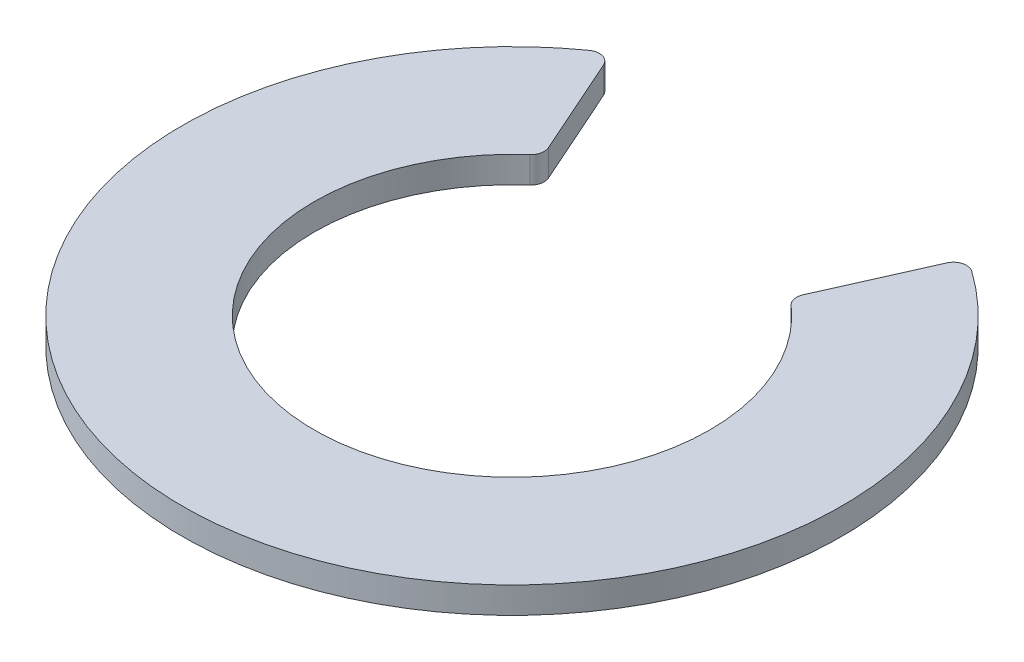
ISO-10303-21;
HEADER;
FILE_DESCRIPTION(('STEP AP214'),'2;1');
FILE_NAME('part.step','',(''),(''),'','','');
FILE_SCHEMA(('AUTOMOTIVE_DESIGN { 1 0 10303 214 1 1 1 1 }'));
ENDSEC;
DATA;
#1=APPLICATION_CONTEXT('core data for automotive mechanical design processes');
#2=APPLICATION_PROTOCOL_DEFINITION('international standard','automotive_design',2000,#1);
#3=PRODUCT_CONTEXT('',#1,'mechanical');
#4=PRODUCT('Part','Part','',(#3));
#5=PRODUCT_RELATED_PRODUCT_CATEGORY('part','',(#4));
#6=PRODUCT_DEFINITION_FORMATION('','',#4);
#7=PRODUCT_DEFINITION_CONTEXT('part definition',#1,'design');
#8=PRODUCT_DEFINITION('design','',#6,#7);
#9=PRODUCT_DEFINITION_SHAPE('','',#8);
#10=(LENGTH_UNIT() NAMED_UNIT(*) SI_UNIT(.MILLI.,.METRE.));
#11=(NAMED_UNIT(*) PLANE_ANGLE_UNIT() SI_UNIT($,.RADIAN.));
#12=(NAMED_UNIT(*) SI_UNIT($,.STERADIAN.) SOLID_ANGLE_UNIT());
#13=UNCERTAINTY_MEASURE_WITH_UNIT(LENGTH_MEASURE(1.E-05),#10,'distance_accuracy_value','');
#14=(GEOMETRIC_REPRESENTATION_CONTEXT(3) GLOBAL_UNCERTAINTY_ASSIGNED_CONTEXT((#13)) GLOBAL_UNIT_ASSIGNED_CONTEXT((#10,
#11,#12)) REPRESENTATION_CONTEXT('',''));
#15=CARTESIAN_POINT('',(0.,0.,0.));
#16=DIRECTION('',(0.,0.,1.));
#17=DIRECTION('',(1.,0.,0.));
#18=AXIS2_PLACEMENT_3D('',#15,#16,#17);
#19=CARTESIAN_POINT('',(13.9235110383462,2.,-19.5482950756595));
#20=DIRECTION('',(0.,-1.,0.));
#21=DIRECTION('',(0.,0.,-1.));
#22=AXIS2_PLACEMENT_3D('',#19,#20,#21);
#23=CYLINDRICAL_SURFACE('',#22,0.999999999999997);
#24=CARTESIAN_POINT('',(13.9235110383462,0.,-19.5482950756595));
#25=DIRECTION('',(0.,1.,0.));
#26=DIRECTION('',(0.,0.,1.));
#27=AXIS2_PLACEMENT_3D('',#24,#25,#26);
#28=CIRCLE('',#27,0.999999999999997);
#29=CARTESIAN_POINT('',(14.5036573316106,0.,-20.3628073704786));
#30=VERTEX_POINT('',#29);
#31=CARTESIAN_POINT('',(13.0097396482997,0.,-19.9545238864699));
#32=VERTEX_POINT('',#31);
#33=EDGE_CURVE('E140',#30,#32,#28,.T.);
#34=ORIENTED_EDGE('',*,*,#33,.T.);
#35=DIRECTION('',(0.,-1.,0.));
#36=VECTOR('',#35,1.);
#37=CARTESIAN_POINT('',(13.0097396482997,2.,-19.9545238864699));
#38=LINE('',#37,#36);
#39=CARTESIAN_POINT('',(13.0097396482997,2.,-19.9545238864699));
#40=VERTEX_POINT('',#39);
#41=EDGE_CURVE('E11',#40,#32,#38,.T.);
#42=ORIENTED_EDGE('',*,*,#41,.F.);
#43=CARTESIAN_POINT('',(13.9235110383462,2.,-19.5482950756595));
#44=DIRECTION('',(0.,1.,0.));
#45=DIRECTION('',(0.,0.,1.));
#46=AXIS2_PLACEMENT_3D('',#43,#44,#45);
#47=CIRCLE('',#46,0.999999999999997);
#48=CARTESIAN_POINT('',(14.5036573316106,2.,-20.3628073704786));
#49=VERTEX_POINT('',#48);
#50=EDGE_CURVE('E162',#49,#40,#47,.T.);
#51=ORIENTED_EDGE('',*,*,#50,.F.);
#52=DIRECTION('',(0.,-1.,0.));
#53=VECTOR('',#52,1.);
#54=CARTESIAN_POINT('',(14.5036573316106,2.,-20.3628073704786));
#55=LINE('',#54,#53);
#56=EDGE_CURVE('E136',#49,#30,#55,.T.);
#57=ORIENTED_EDGE('',*,*,#56,.T.);
#58=EDGE_LOOP('',(#34,#42,#51,#57));
#59=FACE_BOUND('',#58,.T.);
#60=ADVANCED_FACE('F39',(#59),#23,.T.);
#61=CARTESIAN_POINT('',(9.65832226210436,2.,-12.4158431181124));
#62=DIRECTION('',(0.913771390046496,0.,0.406228810810477));
#63=DIRECTION('',(0.406228810810477,0.,-0.913771390046496));
#64=AXIS2_PLACEMENT_3D('',#61,#62,#63);
#65=PLANE('',#64);
#66=DIRECTION('',(-0.406228810810477,0.,0.913771390046496));
#67=VECTOR('',#66,1.);
#68=CARTESIAN_POINT('',(9.65832226210436,0.,-12.4158431181124));
#69=LINE('',#68,#67);
#70=CARTESIAN_POINT('',(9.65832226210436,0.,-12.4158431181124));
#71=VERTEX_POINT('',#70);
#72=EDGE_CURVE('E144',#32,#71,#69,.T.);
#73=ORIENTED_EDGE('',*,*,#72,.T.);
#74=DIRECTION('',(0.,-1.,0.));
#75=VECTOR('',#74,1.);
#76=CARTESIAN_POINT('',(9.65832226210436,2.,-12.4158431181124));
#77=LINE('',#76,#75);
#78=CARTESIAN_POINT('',(9.65832226210436,2.,-12.4158431181124));
#79=VERTEX_POINT('',#78);
#80=EDGE_CURVE('E48',#79,#71,#77,.T.);
#81=ORIENTED_EDGE('',*,*,#80,.F.);
#82=DIRECTION('',(-0.406228810810477,0.,0.913771390046496));
#83=VECTOR('',#82,1.);
#84=CARTESIAN_POINT('',(9.65832226210436,2.,-12.4158431181124));
#85=LINE('',#84,#83);
#86=EDGE_CURVE('E99',#40,#79,#85,.T.);
#87=ORIENTED_EDGE('',*,*,#86,.F.);
#88=ORIENTED_EDGE('',*,*,#41,.T.);
#89=EDGE_LOOP('',(#73,#81,#87,#88));
#90=FACE_BOUND('',#89,.T.);
#91=ADVANCED_FACE('F208',(#90),#65,.F.);
#92=CARTESIAN_POINT('',(10.5720936521509,2.,-12.0096143073019));
#93=DIRECTION('',(0.,-1.,0.));
#94=DIRECTION('',(0.,0.,-1.));
#95=AXIS2_PLACEMENT_3D('',#92,#93,#94);
#96=CYLINDRICAL_SURFACE('',#95,1.);
#97=CARTESIAN_POINT('',(10.5720936521509,0.,-12.0096143073019));
#98=DIRECTION('',(0.,1.,0.));
#99=DIRECTION('',(0.,0.,-1.));
#100=AXIS2_PLACEMENT_3D('',#97,#98,#99);
#101=CIRCLE('',#100,1.);
#102=CARTESIAN_POINT('',(9.91133779889143,0.,-11.2590134130956));
#103=VERTEX_POINT('',#102);
#104=EDGE_CURVE('E147',#71,#103,#101,.T.);
#105=ORIENTED_EDGE('',*,*,#104,.T.);
#106=DIRECTION('',(0.,-1.,0.));
#107=VECTOR('',#106,1.);
#108=CARTESIAN_POINT('',(9.91133779889143,2.,-11.2590134130956));
#109=LINE('',#108,#107);
#110=CARTESIAN_POINT('',(9.91133779889143,2.,-11.2590134130956));
#111=VERTEX_POINT('',#110);
#112=EDGE_CURVE('E173',#111,#103,#109,.T.);
#113=ORIENTED_EDGE('',*,*,#112,.F.);
#114=CARTESIAN_POINT('',(10.5720936521509,2.,-12.0096143073019));
#115=DIRECTION('',(0.,1.,0.));
#116=DIRECTION('',(0.,0.,-1.));
#117=AXIS2_PLACEMENT_3D('',#114,#115,#116);
#118=CIRCLE('',#117,1.);
#119=EDGE_CURVE('E183',#79,#111,#118,.T.);
#120=ORIENTED_EDGE('',*,*,#119,.F.);
#121=ORIENTED_EDGE('',*,*,#80,.T.);
#122=EDGE_LOOP('',(#105,#113,#120,#121));
#123=FACE_BOUND('',#122,.T.);
#124=ADVANCED_FACE('F181',(#123),#96,.T.);
#125=CARTESIAN_POINT('',(0.,2.,0.));
#126=DIRECTION('',(0.,-1.,0.));
#127=DIRECTION('',(0.,0.,-1.));
#128=AXIS2_PLACEMENT_3D('',#125,#126,#127);
#129=CYLINDRICAL_SURFACE('',#128,15.);
#130=CARTESIAN_POINT('',(0.,0.,0.));
#131=DIRECTION('',(0.,-1.,0.));
#132=DIRECTION('',(0.,0.,1.));
#133=AXIS2_PLACEMENT_3D('',#130,#131,#132);
#134=CIRCLE('',#133,15.);
#135=CARTESIAN_POINT('',(-9.91133779889142,0.,-11.2590134130956));
#136=VERTEX_POINT('',#135);
#137=EDGE_CURVE('E150',#103,#136,#134,.T.);
#138=ORIENTED_EDGE('',*,*,#137,.T.);
#139=DIRECTION('',(0.,-1.,0.));
#140=VECTOR('',#139,1.);
#141=CARTESIAN_POINT('',(-9.91133779889142,2.,-11.2590134130956));
#142=LINE('',#141,#140);
#143=CARTESIAN_POINT('',(-9.91133779889142,2.,-11.2590134130956));
#144=VERTEX_POINT('',#143);
#145=EDGE_CURVE('E169',#144,#136,#142,.T.);
#146=ORIENTED_EDGE('',*,*,#145,.F.);
#147=CARTESIAN_POINT('',(0.,2.,0.));
#148=DIRECTION('',(0.,-1.,0.));
#149=DIRECTION('',(0.,0.,1.));
#150=AXIS2_PLACEMENT_3D('',#147,#148,#149);
#151=CIRCLE('',#150,15.);
#152=EDGE_CURVE('E196',#111,#144,#151,.T.);
#153=ORIENTED_EDGE('',*,*,#152,.F.);
#154=ORIENTED_EDGE('',*,*,#112,.T.);
#155=EDGE_LOOP('',(#138,#146,#153,#154));
#156=FACE_BOUND('',#155,.T.);
#157=ADVANCED_FACE('F191',(#156),#129,.F.);
#158=CARTESIAN_POINT('',(-10.5720936521508,2.,-12.0096143073019));
#159=DIRECTION('',(0.,-1.,0.));
#160=DIRECTION('',(0.,0.,-1.));
#161=AXIS2_PLACEMENT_3D('',#158,#159,#160);
#162=CYLINDRICAL_SURFACE('',#161,0.999999999999996);
#163=CARTESIAN_POINT('',(-10.5720936521508,0.,-12.0096143073019));
#164=DIRECTION('',(0.,1.,0.));
#165=DIRECTION('',(0.,0.,1.));
#166=AXIS2_PLACEMENT_3D('',#163,#164,#165);
#167=CIRCLE('',#166,0.999999999999996);
#168=CARTESIAN_POINT('',(-9.65832226210435,0.,-12.4158431181124));
#169=VERTEX_POINT('',#168);
#170=EDGE_CURVE('E153',#136,#169,#167,.T.);
#171=ORIENTED_EDGE('',*,*,#170,.T.);
#172=DIRECTION('',(0.,-1.,0.));
#173=VECTOR('',#172,1.);
#174=CARTESIAN_POINT('',(-9.65832226210435,2.,-12.4158431181124));
#175=LINE('',#174,#173);
#176=CARTESIAN_POINT('',(-9.65832226210435,2.,-12.4158431181124));
#177=VERTEX_POINT('',#176);
#178=EDGE_CURVE('E129',#177,#169,#175,.T.);
#179=ORIENTED_EDGE('',*,*,#178,.F.);
#180=CARTESIAN_POINT('',(-10.5720936521508,2.,-12.0096143073019));
#181=DIRECTION('',(0.,1.,0.));
#182=DIRECTION('',(0.,0.,1.));
#183=AXIS2_PLACEMENT_3D('',#180,#181,#182);
#184=CIRCLE('',#183,0.999999999999996);
#185=EDGE_CURVE('E118',#144,#177,#184,.T.);
#186=ORIENTED_EDGE('',*,*,#185,.F.);
#187=ORIENTED_EDGE('',*,*,#145,.T.);
#188=EDGE_LOOP('',(#171,#179,#186,#187));
#189=FACE_BOUND('',#188,.T.);
#190=ADVANCED_FACE('F194',(#189),#162,.T.);
#191=CARTESIAN_POINT('',(-13.0097396482997,2.,-19.95452388647));
#192=DIRECTION('',(-0.913771390046496,0.,0.406228810810477));
#193=DIRECTION('',(0.406228810810477,0.,0.913771390046496));
#194=AXIS2_PLACEMENT_3D('',#191,#192,#193);
#195=PLANE('',#194);
#196=DIRECTION('',(-0.406228810810477,0.,-0.913771390046496));
#197=VECTOR('',#196,1.);
#198=CARTESIAN_POINT('',(-13.0097396482997,0.,-19.95452388647));
#199=LINE('',#198,#197);
#200=CARTESIAN_POINT('',(-13.0097396482997,0.,-19.95452388647));
#201=VERTEX_POINT('',#200);
#202=EDGE_CURVE('E127',#169,#201,#199,.T.);
#203=ORIENTED_EDGE('',*,*,#202,.T.);
#204=DIRECTION('',(0.,-1.,0.));
#205=VECTOR('',#204,1.);
#206=CARTESIAN_POINT('',(-13.0097396482997,2.,-19.95452388647));
#207=LINE('',#206,#205);
#208=CARTESIAN_POINT('',(-13.0097396482997,2.,-19.95452388647));
#209=VERTEX_POINT('',#208);
#210=EDGE_CURVE('E124',#209,#201,#207,.T.);
#211=ORIENTED_EDGE('',*,*,#210,.F.);
#212=DIRECTION('',(-0.406228810810477,0.,-0.913771390046496));
#213=VECTOR('',#212,1.);
#214=CARTESIAN_POINT('',(-13.0097396482997,2.,-19.95452388647));
#215=LINE('',#214,#213);
#216=EDGE_CURVE('E112',#177,#209,#215,.T.);
#217=ORIENTED_EDGE('',*,*,#216,.F.);
#218=ORIENTED_EDGE('',*,*,#178,.T.);
#219=EDGE_LOOP('',(#203,#211,#217,#218));
#220=FACE_BOUND('',#219,.T.);
#221=ADVANCED_FACE('F125',(#220),#195,.F.);
#222=CARTESIAN_POINT('',(-13.9235110383462,2.,-19.5482950756595));
#223=DIRECTION('',(0.,-1.,0.));
#224=DIRECTION('',(0.,0.,-1.));
#225=AXIS2_PLACEMENT_3D('',#222,#223,#224);
#226=CYLINDRICAL_SURFACE('',#225,1.);
#227=CARTESIAN_POINT('',(-13.9235110383462,0.,-19.5482950756595));
#228=DIRECTION('',(0.,1.,0.));
#229=DIRECTION('',(0.,0.,-1.));
#230=AXIS2_PLACEMENT_3D('',#227,#228,#229);
#231=CIRCLE('',#230,1.);
#232=CARTESIAN_POINT('',(-14.5036573316106,0.,-20.3628073704786));
#233=VERTEX_POINT('',#232);
#234=EDGE_CURVE('E85',#201,#233,#231,.T.);
#235=ORIENTED_EDGE('',*,*,#234,.T.);
#236=DIRECTION('',(0.,-1.,0.));
#237=VECTOR('',#236,1.);
#238=CARTESIAN_POINT('',(-14.5036573316106,2.,-20.3628073704786));
#239=LINE('',#238,#237);
#240=CARTESIAN_POINT('',(-14.5036573316106,2.,-20.3628073704786));
#241=VERTEX_POINT('',#240);
#242=EDGE_CURVE('E130',#241,#233,#239,.T.);
#243=ORIENTED_EDGE('',*,*,#242,.F.);
#244=CARTESIAN_POINT('',(-13.9235110383462,2.,-19.5482950756595));
#245=DIRECTION('',(0.,1.,0.));
#246=DIRECTION('',(0.,0.,-1.));
#247=AXIS2_PLACEMENT_3D('',#244,#245,#246);
#248=CIRCLE('',#247,1.);
#249=EDGE_CURVE('E116',#209,#241,#248,.T.);
#250=ORIENTED_EDGE('',*,*,#249,.F.);
#251=ORIENTED_EDGE('',*,*,#210,.T.);
#252=EDGE_LOOP('',(#235,#243,#250,#251));
#253=FACE_BOUND('',#252,.T.);
#254=ADVANCED_FACE('F132',(#253),#226,.T.);
#255=CARTESIAN_POINT('',(0.,2.,0.));
#256=DIRECTION('',(0.,-1.,0.));
#257=DIRECTION('',(0.,0.,-1.));
#258=AXIS2_PLACEMENT_3D('',#255,#256,#257);
#259=CYLINDRICAL_SURFACE('',#258,25.);
#260=CARTESIAN_POINT('',(0.,0.,0.));
#261=DIRECTION('',(0.,1.,0.));
#262=DIRECTION('',(0.,0.,1.));
#263=AXIS2_PLACEMENT_3D('',#260,#261,#262);
#264=CIRCLE('',#263,25.);
#265=EDGE_CURVE('E91',#233,#30,#264,.T.);
#266=ORIENTED_EDGE('',*,*,#265,.T.);
#267=ORIENTED_EDGE('',*,*,#56,.F.);
#268=CARTESIAN_POINT('',(0.,2.,0.));
#269=DIRECTION('',(0.,1.,0.));
#270=DIRECTION('',(0.,0.,1.));
#271=AXIS2_PLACEMENT_3D('',#268,#269,#270);
#272=CIRCLE('',#271,25.);
#273=EDGE_CURVE('E56',#241,#49,#272,.T.);
#274=ORIENTED_EDGE('',*,*,#273,.F.);
#275=ORIENTED_EDGE('',*,*,#242,.T.);
#276=EDGE_LOOP('',(#266,#267,#274,#275));
#277=FACE_BOUND('',#276,.T.);
#278=ADVANCED_FACE('F224',(#277),#259,.T.);
#279=CARTESIAN_POINT('',(13.9235110383462,2.,-19.5482950756595));
#280=DIRECTION('',(0.,1.,0.));
#281=DIRECTION('',(0.,0.,1.));
#282=AXIS2_PLACEMENT_3D('',#279,#280,#281);
#283=PLANE('',#282);
#284=ORIENTED_EDGE('',*,*,#50,.T.);
#285=ORIENTED_EDGE('',*,*,#86,.T.);
#286=ORIENTED_EDGE('',*,*,#119,.T.);
#287=ORIENTED_EDGE('',*,*,#152,.T.);
#288=ORIENTED_EDGE('',*,*,#185,.T.);
#289=ORIENTED_EDGE('',*,*,#216,.T.);
#290=ORIENTED_EDGE('',*,*,#249,.T.);
#291=ORIENTED_EDGE('',*,*,#273,.T.);
#292=EDGE_LOOP('',(#284,#285,#286,#287,#288,#289,#290,#291));
#293=FACE_BOUND('',#292,.T.);
#294=ADVANCED_FACE('F114',(#293),#283,.T.);
#295=CARTESIAN_POINT('',(13.9235110383462,0.,-19.5482950756595));
#296=DIRECTION('',(0.,1.,0.));
#297=DIRECTION('',(0.,0.,1.));
#298=AXIS2_PLACEMENT_3D('',#295,#296,#297);
#299=PLANE('',#298);
#300=ORIENTED_EDGE('',*,*,#33,.F.);
#301=ORIENTED_EDGE('',*,*,#265,.F.);
#302=ORIENTED_EDGE('',*,*,#234,.F.);
#303=ORIENTED_EDGE('',*,*,#202,.F.);
#304=ORIENTED_EDGE('',*,*,#170,.F.);
#305=ORIENTED_EDGE('',*,*,#137,.F.);
#306=ORIENTED_EDGE('',*,*,#104,.F.);
#307=ORIENTED_EDGE('',*,*,#72,.F.);
#308=EDGE_LOOP('',(#300,#301,#302,#303,#304,#305,#306,#307));
#309=FACE_BOUND('',#308,.T.);
#310=ADVANCED_FACE('F187',(#309),#299,.F.);
#311=CLOSED_SHELL('',(#60,#91,#124,#157,#190,#221,#254,#278,#294,#310));
#312=MANIFOLD_SOLID_BREP('B2',#311);
#313=ADVANCED_BREP_SHAPE_REPRESENTATION('',(#18,#312),#14);
#314=SHAPE_DEFINITION_REPRESENTATION(#9,#313);
ENDSEC;
END-ISO-10303-21;
